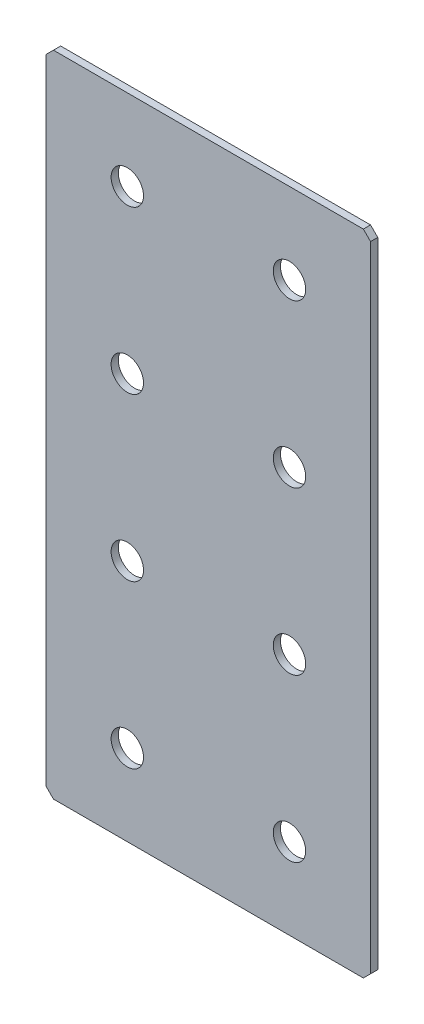
ISO-10303-21;
HEADER;
FILE_DESCRIPTION(('STEP AP214'),'2;1');
FILE_NAME('part.step','',(''),(''),'','','');
FILE_SCHEMA(('AUTOMOTIVE_DESIGN { 1 0 10303 214 1 1 1 1 }'));
ENDSEC;
DATA;
#1=APPLICATION_CONTEXT('core data for automotive mechanical design processes');
#2=APPLICATION_PROTOCOL_DEFINITION('international standard','automotive_design',2000,#1);
#3=PRODUCT_CONTEXT('',#1,'mechanical');
#4=PRODUCT('Part','Part','',(#3));
#5=PRODUCT_RELATED_PRODUCT_CATEGORY('part','',(#4));
#6=PRODUCT_DEFINITION_FORMATION('','',#4);
#7=PRODUCT_DEFINITION_CONTEXT('part definition',#1,'design');
#8=PRODUCT_DEFINITION('design','',#6,#7);
#9=PRODUCT_DEFINITION_SHAPE('','',#8);
#10=(LENGTH_UNIT() NAMED_UNIT(*) SI_UNIT(.MILLI.,.METRE.));
#11=(NAMED_UNIT(*) PLANE_ANGLE_UNIT() SI_UNIT($,.RADIAN.));
#12=(NAMED_UNIT(*) SI_UNIT($,.STERADIAN.) SOLID_ANGLE_UNIT());
#13=UNCERTAINTY_MEASURE_WITH_UNIT(LENGTH_MEASURE(1.E-05),#10,'distance_accuracy_value','');
#14=(GEOMETRIC_REPRESENTATION_CONTEXT(3) GLOBAL_UNCERTAINTY_ASSIGNED_CONTEXT((#13)) GLOBAL_UNIT_ASSIGNED_CONTEXT((#10,
#11,#12)) REPRESENTATION_CONTEXT('',''));
#15=CARTESIAN_POINT('',(0.,0.,0.));
#16=DIRECTION('',(0.,0.,1.));
#17=DIRECTION('',(1.,0.,0.));
#18=AXIS2_PLACEMENT_3D('',#15,#16,#17);
#19=CARTESIAN_POINT('',(45.,-90.,2.));
#20=DIRECTION('',(-1.,0.,0.));
#21=DIRECTION('',(0.,0.,1.));
#22=AXIS2_PLACEMENT_3D('',#19,#20,#21);
#23=PLANE('',#22);
#24=DIRECTION('',(0.,1.,0.));
#25=VECTOR('',#24,1.);
#26=CARTESIAN_POINT('',(45.,-90.,2.));
#27=LINE('',#26,#25);
#28=CARTESIAN_POINT('',(45.,-88.,2.));
#29=VERTEX_POINT('',#28);
#30=CARTESIAN_POINT('',(45.,87.9999999999999,2.));
#31=VERTEX_POINT('',#30);
#32=EDGE_CURVE('E128',#29,#31,#27,.T.);
#33=ORIENTED_EDGE('',*,*,#32,.F.);
#34=DIRECTION('',(0.,0.,-1.));
#35=VECTOR('',#34,1.);
#36=CARTESIAN_POINT('',(45.,-88.,2.));
#37=LINE('',#36,#35);
#38=CARTESIAN_POINT('',(45.,-88.,0.));
#39=VERTEX_POINT('',#38);
#40=EDGE_CURVE('E154',#29,#39,#37,.T.);
#41=ORIENTED_EDGE('',*,*,#40,.T.);
#42=DIRECTION('',(0.,1.,0.));
#43=VECTOR('',#42,1.);
#44=CARTESIAN_POINT('',(45.,-90.,0.));
#45=LINE('',#44,#43);
#46=CARTESIAN_POINT('',(45.,87.9999999999999,0.));
#47=VERTEX_POINT('',#46);
#48=EDGE_CURVE('E162',#39,#47,#45,.T.);
#49=ORIENTED_EDGE('',*,*,#48,.T.);
#50=DIRECTION('',(0.,0.,1.));
#51=VECTOR('',#50,1.);
#52=CARTESIAN_POINT('',(45.,88.,2.));
#53=LINE('',#52,#51);
#54=EDGE_CURVE('E152',#47,#31,#53,.T.);
#55=ORIENTED_EDGE('',*,*,#54,.T.);
#56=EDGE_LOOP('',(#33,#41,#49,#55));
#57=FACE_BOUND('',#56,.T.);
#58=ADVANCED_FACE('F37',(#57),#23,.F.);
#59=CARTESIAN_POINT('',(-45.,90.,2.));
#60=DIRECTION('',(0.,-1.,0.));
#61=DIRECTION('',(0.,0.,-1.));
#62=AXIS2_PLACEMENT_3D('',#59,#60,#61);
#63=PLANE('',#62);
#64=DIRECTION('',(-1.,0.,0.));
#65=VECTOR('',#64,1.);
#66=CARTESIAN_POINT('',(-45.,90.,0.));
#67=LINE('',#66,#65);
#68=CARTESIAN_POINT('',(43.,90.,0.));
#69=VERTEX_POINT('',#68);
#70=CARTESIAN_POINT('',(-43.,90.,0.));
#71=VERTEX_POINT('',#70);
#72=EDGE_CURVE('E133',#69,#71,#67,.T.);
#73=ORIENTED_EDGE('',*,*,#72,.T.);
#74=DIRECTION('',(0.,0.,1.));
#75=VECTOR('',#74,1.);
#76=CARTESIAN_POINT('',(-43.,90.,2.));
#77=LINE('',#76,#75);
#78=CARTESIAN_POINT('',(-43.,90.,2.));
#79=VERTEX_POINT('',#78);
#80=EDGE_CURVE('E11',#71,#79,#77,.T.);
#81=ORIENTED_EDGE('',*,*,#80,.T.);
#82=DIRECTION('',(-1.,0.,0.));
#83=VECTOR('',#82,1.);
#84=CARTESIAN_POINT('',(-45.,90.,2.));
#85=LINE('',#84,#83);
#86=CARTESIAN_POINT('',(43.,90.,2.));
#87=VERTEX_POINT('',#86);
#88=EDGE_CURVE('E131',#87,#79,#85,.T.);
#89=ORIENTED_EDGE('',*,*,#88,.F.);
#90=DIRECTION('',(0.,0.,-1.));
#91=VECTOR('',#90,1.);
#92=CARTESIAN_POINT('',(43.,90.,2.));
#93=LINE('',#92,#91);
#94=EDGE_CURVE('E45',#87,#69,#93,.T.);
#95=ORIENTED_EDGE('',*,*,#94,.T.);
#96=EDGE_LOOP('',(#73,#81,#89,#95));
#97=FACE_BOUND('',#96,.T.);
#98=ADVANCED_FACE('F159',(#97),#63,.F.);
#99=CARTESIAN_POINT('',(-45.,-90.,2.));
#100=DIRECTION('',(1.,0.,0.));
#101=DIRECTION('',(0.,0.,-1.));
#102=AXIS2_PLACEMENT_3D('',#99,#100,#101);
#103=PLANE('',#102);
#104=DIRECTION('',(0.,-1.,0.));
#105=VECTOR('',#104,1.);
#106=CARTESIAN_POINT('',(-45.,-90.,0.));
#107=LINE('',#106,#105);
#108=CARTESIAN_POINT('',(-45.,88.,0.));
#109=VERTEX_POINT('',#108);
#110=CARTESIAN_POINT('',(-45.,-88.,0.));
#111=VERTEX_POINT('',#110);
#112=EDGE_CURVE('E129',#109,#111,#107,.T.);
#113=ORIENTED_EDGE('',*,*,#112,.T.);
#114=DIRECTION('',(0.,0.,1.));
#115=VECTOR('',#114,1.);
#116=CARTESIAN_POINT('',(-45.,-88.,2.));
#117=LINE('',#116,#115);
#118=CARTESIAN_POINT('',(-45.,-88.,2.));
#119=VERTEX_POINT('',#118);
#120=EDGE_CURVE('E107',#111,#119,#117,.T.);
#121=ORIENTED_EDGE('',*,*,#120,.T.);
#122=DIRECTION('',(0.,-1.,0.));
#123=VECTOR('',#122,1.);
#124=CARTESIAN_POINT('',(-45.,-90.,2.));
#125=LINE('',#124,#123);
#126=CARTESIAN_POINT('',(-45.,88.,2.));
#127=VERTEX_POINT('',#126);
#128=EDGE_CURVE('E167',#127,#119,#125,.T.);
#129=ORIENTED_EDGE('',*,*,#128,.F.);
#130=DIRECTION('',(0.,0.,-1.));
#131=VECTOR('',#130,1.);
#132=CARTESIAN_POINT('',(-45.,88.,2.));
#133=LINE('',#132,#131);
#134=EDGE_CURVE('E112',#127,#109,#133,.T.);
#135=ORIENTED_EDGE('',*,*,#134,.T.);
#136=EDGE_LOOP('',(#113,#121,#129,#135));
#137=FACE_BOUND('',#136,.T.);
#138=ADVANCED_FACE('F242',(#137),#103,.F.);
#139=CARTESIAN_POINT('',(-45.,-90.,2.));
#140=DIRECTION('',(0.,1.,0.));
#141=DIRECTION('',(0.,0.,1.));
#142=AXIS2_PLACEMENT_3D('',#139,#140,#141);
#143=PLANE('',#142);
#144=DIRECTION('',(1.,0.,0.));
#145=VECTOR('',#144,1.);
#146=CARTESIAN_POINT('',(-45.,-90.,2.));
#147=LINE('',#146,#145);
#148=CARTESIAN_POINT('',(-43.,-90.,2.));
#149=VERTEX_POINT('',#148);
#150=CARTESIAN_POINT('',(43.,-90.,2.));
#151=VERTEX_POINT('',#150);
#152=EDGE_CURVE('E122',#149,#151,#147,.T.);
#153=ORIENTED_EDGE('',*,*,#152,.F.);
#154=DIRECTION('',(0.,0.,-1.));
#155=VECTOR('',#154,1.);
#156=CARTESIAN_POINT('',(-43.,-90.,2.));
#157=LINE('',#156,#155);
#158=CARTESIAN_POINT('',(-43.,-90.,0.));
#159=VERTEX_POINT('',#158);
#160=EDGE_CURVE('E106',#149,#159,#157,.T.);
#161=ORIENTED_EDGE('',*,*,#160,.T.);
#162=DIRECTION('',(1.,0.,0.));
#163=VECTOR('',#162,1.);
#164=CARTESIAN_POINT('',(-45.,-90.,0.));
#165=LINE('',#164,#163);
#166=CARTESIAN_POINT('',(43.,-90.,0.));
#167=VERTEX_POINT('',#166);
#168=EDGE_CURVE('E119',#159,#167,#165,.T.);
#169=ORIENTED_EDGE('',*,*,#168,.T.);
#170=DIRECTION('',(0.,0.,1.));
#171=VECTOR('',#170,1.);
#172=CARTESIAN_POINT('',(43.,-90.,2.));
#173=LINE('',#172,#171);
#174=EDGE_CURVE('E124',#167,#151,#173,.T.);
#175=ORIENTED_EDGE('',*,*,#174,.T.);
#176=EDGE_LOOP('',(#153,#161,#169,#175));
#177=FACE_BOUND('',#176,.T.);
#178=ADVANCED_FACE('F118',(#177),#143,.F.);
#179=CARTESIAN_POINT('',(0.,0.,2.));
#180=DIRECTION('',(0.,0.,-1.));
#181=DIRECTION('',(-1.,0.,0.));
#182=AXIS2_PLACEMENT_3D('',#179,#180,#181);
#183=PLANE('',#182);
#184=CARTESIAN_POINT('',(-22.5,22.5,2.));
#185=DIRECTION('',(0.,0.,1.));
#186=DIRECTION('',(1.,0.,0.));
#187=AXIS2_PLACEMENT_3D('',#184,#185,#186);
#188=CIRCLE('',#187,4.5);
#189=CARTESIAN_POINT('',(-18.,22.5,2.));
#190=VERTEX_POINT('',#189);
#191=EDGE_CURVE('E215',#190,#190,#188,.T.);
#192=ORIENTED_EDGE('',*,*,#191,.F.);
#193=EDGE_LOOP('',(#192));
#194=FACE_BOUND('',#193,.T.);
#195=CARTESIAN_POINT('',(22.5,22.5,2.));
#196=DIRECTION('',(0.,0.,1.));
#197=DIRECTION('',(1.,0.,0.));
#198=AXIS2_PLACEMENT_3D('',#195,#196,#197);
#199=CIRCLE('',#198,4.5);
#200=CARTESIAN_POINT('',(27.,22.5,2.));
#201=VERTEX_POINT('',#200);
#202=EDGE_CURVE('E209',#201,#201,#199,.T.);
#203=ORIENTED_EDGE('',*,*,#202,.F.);
#204=EDGE_LOOP('',(#203));
#205=FACE_BOUND('',#204,.T.);
#206=CARTESIAN_POINT('',(-22.5,-22.5,2.));
#207=DIRECTION('',(0.,0.,1.));
#208=DIRECTION('',(1.,0.,0.));
#209=AXIS2_PLACEMENT_3D('',#206,#207,#208);
#210=CIRCLE('',#209,4.5);
#211=CARTESIAN_POINT('',(-18.,-22.5,2.));
#212=VERTEX_POINT('',#211);
#213=EDGE_CURVE('E203',#212,#212,#210,.T.);
#214=ORIENTED_EDGE('',*,*,#213,.F.);
#215=EDGE_LOOP('',(#214));
#216=FACE_BOUND('',#215,.T.);
#217=CARTESIAN_POINT('',(22.5,-22.5,2.));
#218=DIRECTION('',(0.,0.,1.));
#219=DIRECTION('',(1.,0.,0.));
#220=AXIS2_PLACEMENT_3D('',#217,#218,#219);
#221=CIRCLE('',#220,4.5);
#222=CARTESIAN_POINT('',(27.,-22.5,2.));
#223=VERTEX_POINT('',#222);
#224=EDGE_CURVE('E197',#223,#223,#221,.T.);
#225=ORIENTED_EDGE('',*,*,#224,.F.);
#226=EDGE_LOOP('',(#225));
#227=FACE_BOUND('',#226,.T.);
#228=CARTESIAN_POINT('',(-22.5,67.5,2.));
#229=DIRECTION('',(0.,0.,1.));
#230=DIRECTION('',(1.,0.,0.));
#231=AXIS2_PLACEMENT_3D('',#228,#229,#230);
#232=CIRCLE('',#231,4.5);
#233=CARTESIAN_POINT('',(-18.,67.5,2.));
#234=VERTEX_POINT('',#233);
#235=EDGE_CURVE('E191',#234,#234,#232,.T.);
#236=ORIENTED_EDGE('',*,*,#235,.F.);
#237=EDGE_LOOP('',(#236));
#238=FACE_BOUND('',#237,.T.);
#239=CARTESIAN_POINT('',(22.5,67.5,2.));
#240=DIRECTION('',(0.,0.,1.));
#241=DIRECTION('',(1.,0.,0.));
#242=AXIS2_PLACEMENT_3D('',#239,#240,#241);
#243=CIRCLE('',#242,4.5);
#244=CARTESIAN_POINT('',(27.,67.5,2.));
#245=VERTEX_POINT('',#244);
#246=EDGE_CURVE('E185',#245,#245,#243,.T.);
#247=ORIENTED_EDGE('',*,*,#246,.F.);
#248=EDGE_LOOP('',(#247));
#249=FACE_BOUND('',#248,.T.);
#250=CARTESIAN_POINT('',(22.5,-67.5,2.));
#251=DIRECTION('',(0.,0.,1.));
#252=DIRECTION('',(1.,0.,0.));
#253=AXIS2_PLACEMENT_3D('',#250,#251,#252);
#254=CIRCLE('',#253,4.5);
#255=CARTESIAN_POINT('',(27.,-67.5,2.));
#256=VERTEX_POINT('',#255);
#257=EDGE_CURVE('E179',#256,#256,#254,.T.);
#258=ORIENTED_EDGE('',*,*,#257,.F.);
#259=EDGE_LOOP('',(#258));
#260=FACE_BOUND('',#259,.T.);
#261=CARTESIAN_POINT('',(-22.5,-67.5,2.));
#262=DIRECTION('',(0.,0.,1.));
#263=DIRECTION('',(1.,0.,0.));
#264=AXIS2_PLACEMENT_3D('',#261,#262,#263);
#265=CIRCLE('',#264,4.5);
#266=CARTESIAN_POINT('',(-18.,-67.5,2.));
#267=VERTEX_POINT('',#266);
#268=EDGE_CURVE('E173',#267,#267,#265,.T.);
#269=ORIENTED_EDGE('',*,*,#268,.F.);
#270=EDGE_LOOP('',(#269));
#271=FACE_BOUND('',#270,.T.);
#272=ORIENTED_EDGE('',*,*,#128,.T.);
#273=DIRECTION('',(-0.707106781186548,0.707106781186548,0.));
#274=VECTOR('',#273,1.);
#275=CARTESIAN_POINT('',(-43.,-90.,2.));
#276=LINE('',#275,#274);
#277=EDGE_CURVE('E150',#119,#149,#276,.F.);
#278=ORIENTED_EDGE('',*,*,#277,.T.);
#279=ORIENTED_EDGE('',*,*,#152,.T.);
#280=DIRECTION('',(-0.707106781186552,-0.707106781186543,0.));
#281=VECTOR('',#280,1.);
#282=CARTESIAN_POINT('',(45.,-88.,2.));
#283=LINE('',#282,#281);
#284=EDGE_CURVE('E148',#151,#29,#283,.F.);
#285=ORIENTED_EDGE('',*,*,#284,.T.);
#286=ORIENTED_EDGE('',*,*,#32,.T.);
#287=DIRECTION('',(0.707106781186548,-0.707106781186548,0.));
#288=VECTOR('',#287,1.);
#289=CARTESIAN_POINT('',(43.,90.,2.));
#290=LINE('',#289,#288);
#291=EDGE_CURVE('E57',#31,#87,#290,.F.);
#292=ORIENTED_EDGE('',*,*,#291,.T.);
#293=ORIENTED_EDGE('',*,*,#88,.T.);
#294=DIRECTION('',(0.707106781186552,0.707106781186543,0.));
#295=VECTOR('',#294,1.);
#296=CARTESIAN_POINT('',(-45.,88.,2.));
#297=LINE('',#296,#295);
#298=EDGE_CURVE('E146',#79,#127,#297,.F.);
#299=ORIENTED_EDGE('',*,*,#298,.T.);
#300=EDGE_LOOP('',(#272,#278,#279,#285,#286,#292,#293,#299));
#301=FACE_BOUND('',#300,.T.);
#302=ADVANCED_FACE('F221',(#194,#205,#216,#227,#238,#249,#260,#271,#301),#183,.F.);
#303=CARTESIAN_POINT('',(0.,0.,0.));
#304=DIRECTION('',(0.,0.,-1.));
#305=DIRECTION('',(-1.,0.,0.));
#306=AXIS2_PLACEMENT_3D('',#303,#304,#305);
#307=PLANE('',#306);
#308=CARTESIAN_POINT('',(-22.5,22.5,0.));
#309=DIRECTION('',(0.,0.,1.));
#310=DIRECTION('',(1.,0.,0.));
#311=AXIS2_PLACEMENT_3D('',#308,#309,#310);
#312=CIRCLE('',#311,4.5);
#313=CARTESIAN_POINT('',(-18.,22.5,0.));
#314=VERTEX_POINT('',#313);
#315=EDGE_CURVE('E212',#314,#314,#312,.T.);
#316=ORIENTED_EDGE('',*,*,#315,.T.);
#317=EDGE_LOOP('',(#316));
#318=FACE_BOUND('',#317,.T.);
#319=CARTESIAN_POINT('',(22.5,22.5,0.));
#320=DIRECTION('',(0.,0.,1.));
#321=DIRECTION('',(1.,0.,0.));
#322=AXIS2_PLACEMENT_3D('',#319,#320,#321);
#323=CIRCLE('',#322,4.5);
#324=CARTESIAN_POINT('',(27.,22.5,0.));
#325=VERTEX_POINT('',#324);
#326=EDGE_CURVE('E206',#325,#325,#323,.T.);
#327=ORIENTED_EDGE('',*,*,#326,.T.);
#328=EDGE_LOOP('',(#327));
#329=FACE_BOUND('',#328,.T.);
#330=CARTESIAN_POINT('',(-22.5,-22.5,0.));
#331=DIRECTION('',(0.,0.,1.));
#332=DIRECTION('',(1.,0.,0.));
#333=AXIS2_PLACEMENT_3D('',#330,#331,#332);
#334=CIRCLE('',#333,4.5);
#335=CARTESIAN_POINT('',(-18.,-22.5,0.));
#336=VERTEX_POINT('',#335);
#337=EDGE_CURVE('E200',#336,#336,#334,.T.);
#338=ORIENTED_EDGE('',*,*,#337,.T.);
#339=EDGE_LOOP('',(#338));
#340=FACE_BOUND('',#339,.T.);
#341=CARTESIAN_POINT('',(22.5,-22.5,0.));
#342=DIRECTION('',(0.,0.,1.));
#343=DIRECTION('',(1.,0.,0.));
#344=AXIS2_PLACEMENT_3D('',#341,#342,#343);
#345=CIRCLE('',#344,4.5);
#346=CARTESIAN_POINT('',(27.,-22.5,0.));
#347=VERTEX_POINT('',#346);
#348=EDGE_CURVE('E194',#347,#347,#345,.T.);
#349=ORIENTED_EDGE('',*,*,#348,.T.);
#350=EDGE_LOOP('',(#349));
#351=FACE_BOUND('',#350,.T.);
#352=CARTESIAN_POINT('',(-22.5,67.5,0.));
#353=DIRECTION('',(0.,0.,1.));
#354=DIRECTION('',(1.,0.,0.));
#355=AXIS2_PLACEMENT_3D('',#352,#353,#354);
#356=CIRCLE('',#355,4.5);
#357=CARTESIAN_POINT('',(-18.,67.5,0.));
#358=VERTEX_POINT('',#357);
#359=EDGE_CURVE('E188',#358,#358,#356,.T.);
#360=ORIENTED_EDGE('',*,*,#359,.T.);
#361=EDGE_LOOP('',(#360));
#362=FACE_BOUND('',#361,.T.);
#363=CARTESIAN_POINT('',(22.5,67.5,0.));
#364=DIRECTION('',(0.,0.,1.));
#365=DIRECTION('',(1.,0.,0.));
#366=AXIS2_PLACEMENT_3D('',#363,#364,#365);
#367=CIRCLE('',#366,4.5);
#368=CARTESIAN_POINT('',(27.,67.5,0.));
#369=VERTEX_POINT('',#368);
#370=EDGE_CURVE('E182',#369,#369,#367,.T.);
#371=ORIENTED_EDGE('',*,*,#370,.T.);
#372=EDGE_LOOP('',(#371));
#373=FACE_BOUND('',#372,.T.);
#374=CARTESIAN_POINT('',(22.5,-67.5,0.));
#375=DIRECTION('',(0.,0.,1.));
#376=DIRECTION('',(1.,0.,0.));
#377=AXIS2_PLACEMENT_3D('',#374,#375,#376);
#378=CIRCLE('',#377,4.5);
#379=CARTESIAN_POINT('',(27.,-67.5,0.));
#380=VERTEX_POINT('',#379);
#381=EDGE_CURVE('E176',#380,#380,#378,.T.);
#382=ORIENTED_EDGE('',*,*,#381,.T.);
#383=EDGE_LOOP('',(#382));
#384=FACE_BOUND('',#383,.T.);
#385=CARTESIAN_POINT('',(-22.5,-67.5,0.));
#386=DIRECTION('',(0.,0.,1.));
#387=DIRECTION('',(1.,0.,0.));
#388=AXIS2_PLACEMENT_3D('',#385,#386,#387);
#389=CIRCLE('',#388,4.5);
#390=CARTESIAN_POINT('',(-18.,-67.5,0.));
#391=VERTEX_POINT('',#390);
#392=EDGE_CURVE('E163',#391,#391,#389,.T.);
#393=ORIENTED_EDGE('',*,*,#392,.T.);
#394=EDGE_LOOP('',(#393));
#395=FACE_BOUND('',#394,.T.);
#396=ORIENTED_EDGE('',*,*,#168,.F.);
#397=DIRECTION('',(0.707106781186548,-0.707106781186548,0.));
#398=VECTOR('',#397,1.);
#399=CARTESIAN_POINT('',(-66.5,-66.5,0.));
#400=LINE('',#399,#398);
#401=EDGE_CURVE('E102',#159,#111,#400,.F.);
#402=ORIENTED_EDGE('',*,*,#401,.T.);
#403=ORIENTED_EDGE('',*,*,#112,.F.);
#404=DIRECTION('',(-0.707106781186552,-0.707106781186543,0.));
#405=VECTOR('',#404,1.);
#406=CARTESIAN_POINT('',(-66.4999999999997,66.5000000000006,0.));
#407=LINE('',#406,#405);
#408=EDGE_CURVE('E139',#109,#71,#407,.F.);
#409=ORIENTED_EDGE('',*,*,#408,.T.);
#410=ORIENTED_EDGE('',*,*,#72,.F.);
#411=DIRECTION('',(-0.707106781186548,0.707106781186548,0.));
#412=VECTOR('',#411,1.);
#413=CARTESIAN_POINT('',(66.5,66.5,0.));
#414=LINE('',#413,#412);
#415=EDGE_CURVE('E123',#69,#47,#414,.F.);
#416=ORIENTED_EDGE('',*,*,#415,.T.);
#417=ORIENTED_EDGE('',*,*,#48,.F.);
#418=DIRECTION('',(0.707106781186552,0.707106781186543,0.));
#419=VECTOR('',#418,1.);
#420=CARTESIAN_POINT('',(66.4999999999997,-66.5000000000006,0.));
#421=LINE('',#420,#419);
#422=EDGE_CURVE('E113',#39,#167,#421,.F.);
#423=ORIENTED_EDGE('',*,*,#422,.T.);
#424=EDGE_LOOP('',(#396,#402,#403,#409,#410,#416,#417,#423));
#425=FACE_BOUND('',#424,.T.);
#426=ADVANCED_FACE('F126',(#318,#329,#340,#351,#362,#373,#384,#395,#425),#307,.T.);
#427=CARTESIAN_POINT('',(-43.,-90.,2.));
#428=DIRECTION('',(0.707106781186547,0.707106781186547,0.));
#429=DIRECTION('',(0.,0.,-1.));
#430=AXIS2_PLACEMENT_3D('',#427,#428,#429);
#431=PLANE('',#430);
#432=ORIENTED_EDGE('',*,*,#277,.F.);
#433=ORIENTED_EDGE('',*,*,#120,.F.);
#434=ORIENTED_EDGE('',*,*,#401,.F.);
#435=ORIENTED_EDGE('',*,*,#160,.F.);
#436=EDGE_LOOP('',(#432,#433,#434,#435));
#437=FACE_BOUND('',#436,.T.);
#438=ADVANCED_FACE('F105',(#437),#431,.F.);
#439=CARTESIAN_POINT('',(45.,-88.,2.));
#440=DIRECTION('',(-0.707106781186543,0.707106781186552,0.));
#441=DIRECTION('',(0.,0.,-1.));
#442=AXIS2_PLACEMENT_3D('',#439,#440,#441);
#443=PLANE('',#442);
#444=ORIENTED_EDGE('',*,*,#284,.F.);
#445=ORIENTED_EDGE('',*,*,#174,.F.);
#446=ORIENTED_EDGE('',*,*,#422,.F.);
#447=ORIENTED_EDGE('',*,*,#40,.F.);
#448=EDGE_LOOP('',(#444,#445,#446,#447));
#449=FACE_BOUND('',#448,.T.);
#450=ADVANCED_FACE('F246',(#449),#443,.F.);
#451=CARTESIAN_POINT('',(-45.,88.,2.));
#452=DIRECTION('',(0.707106781186543,-0.707106781186552,0.));
#453=DIRECTION('',(0.,0.,-1.));
#454=AXIS2_PLACEMENT_3D('',#451,#452,#453);
#455=PLANE('',#454);
#456=ORIENTED_EDGE('',*,*,#298,.F.);
#457=ORIENTED_EDGE('',*,*,#80,.F.);
#458=ORIENTED_EDGE('',*,*,#408,.F.);
#459=ORIENTED_EDGE('',*,*,#134,.F.);
#460=EDGE_LOOP('',(#456,#457,#458,#459));
#461=FACE_BOUND('',#460,.T.);
#462=ADVANCED_FACE('F244',(#461),#455,.F.);
#463=CARTESIAN_POINT('',(43.,90.,2.));
#464=DIRECTION('',(-0.707106781186547,-0.707106781186547,0.));
#465=DIRECTION('',(0.,0.,-1.));
#466=AXIS2_PLACEMENT_3D('',#463,#464,#465);
#467=PLANE('',#466);
#468=ORIENTED_EDGE('',*,*,#291,.F.);
#469=ORIENTED_EDGE('',*,*,#54,.F.);
#470=ORIENTED_EDGE('',*,*,#415,.F.);
#471=ORIENTED_EDGE('',*,*,#94,.F.);
#472=EDGE_LOOP('',(#468,#469,#470,#471));
#473=FACE_BOUND('',#472,.T.);
#474=ADVANCED_FACE('F39',(#473),#467,.F.);
#475=CARTESIAN_POINT('',(-22.5,-67.5,2.));
#476=DIRECTION('',(0.,0.,1.));
#477=DIRECTION('',(1.,0.,0.));
#478=AXIS2_PLACEMENT_3D('',#475,#476,#477);
#479=CYLINDRICAL_SURFACE('',#478,4.5);
#480=ORIENTED_EDGE('',*,*,#392,.F.);
#481=EDGE_LOOP('',(#480));
#482=FACE_BOUND('',#481,.T.);
#483=ORIENTED_EDGE('',*,*,#268,.T.);
#484=EDGE_LOOP('',(#483));
#485=FACE_BOUND('',#484,.T.);
#486=ADVANCED_FACE('F251',(#482,#485),#479,.F.);
#487=CARTESIAN_POINT('',(22.5,-67.5,2.));
#488=DIRECTION('',(0.,0.,1.));
#489=DIRECTION('',(1.,0.,0.));
#490=AXIS2_PLACEMENT_3D('',#487,#488,#489);
#491=CYLINDRICAL_SURFACE('',#490,4.5);
#492=ORIENTED_EDGE('',*,*,#381,.F.);
#493=EDGE_LOOP('',(#492));
#494=FACE_BOUND('',#493,.T.);
#495=ORIENTED_EDGE('',*,*,#257,.T.);
#496=EDGE_LOOP('',(#495));
#497=FACE_BOUND('',#496,.T.);
#498=ADVANCED_FACE('F306',(#494,#497),#491,.F.);
#499=CARTESIAN_POINT('',(22.5,67.5,2.));
#500=DIRECTION('',(0.,0.,1.));
#501=DIRECTION('',(1.,0.,0.));
#502=AXIS2_PLACEMENT_3D('',#499,#500,#501);
#503=CYLINDRICAL_SURFACE('',#502,4.5);
#504=ORIENTED_EDGE('',*,*,#370,.F.);
#505=EDGE_LOOP('',(#504));
#506=FACE_BOUND('',#505,.T.);
#507=ORIENTED_EDGE('',*,*,#246,.T.);
#508=EDGE_LOOP('',(#507));
#509=FACE_BOUND('',#508,.T.);
#510=ADVANCED_FACE('F315',(#506,#509),#503,.F.);
#511=CARTESIAN_POINT('',(-22.5,67.5,2.));
#512=DIRECTION('',(0.,0.,1.));
#513=DIRECTION('',(1.,0.,0.));
#514=AXIS2_PLACEMENT_3D('',#511,#512,#513);
#515=CYLINDRICAL_SURFACE('',#514,4.5);
#516=ORIENTED_EDGE('',*,*,#359,.F.);
#517=EDGE_LOOP('',(#516));
#518=FACE_BOUND('',#517,.T.);
#519=ORIENTED_EDGE('',*,*,#235,.T.);
#520=EDGE_LOOP('',(#519));
#521=FACE_BOUND('',#520,.T.);
#522=ADVANCED_FACE('F325',(#518,#521),#515,.F.);
#523=CARTESIAN_POINT('',(22.5,-22.5,2.));
#524=DIRECTION('',(0.,0.,1.));
#525=DIRECTION('',(1.,0.,0.));
#526=AXIS2_PLACEMENT_3D('',#523,#524,#525);
#527=CYLINDRICAL_SURFACE('',#526,4.5);
#528=ORIENTED_EDGE('',*,*,#348,.F.);
#529=EDGE_LOOP('',(#528));
#530=FACE_BOUND('',#529,.T.);
#531=ORIENTED_EDGE('',*,*,#224,.T.);
#532=EDGE_LOOP('',(#531));
#533=FACE_BOUND('',#532,.T.);
#534=ADVANCED_FACE('F335',(#530,#533),#527,.F.);
#535=CARTESIAN_POINT('',(-22.5,-22.5,2.));
#536=DIRECTION('',(0.,0.,1.));
#537=DIRECTION('',(1.,0.,0.));
#538=AXIS2_PLACEMENT_3D('',#535,#536,#537);
#539=CYLINDRICAL_SURFACE('',#538,4.5);
#540=ORIENTED_EDGE('',*,*,#337,.F.);
#541=EDGE_LOOP('',(#540));
#542=FACE_BOUND('',#541,.T.);
#543=ORIENTED_EDGE('',*,*,#213,.T.);
#544=EDGE_LOOP('',(#543));
#545=FACE_BOUND('',#544,.T.);
#546=ADVANCED_FACE('F345',(#542,#545),#539,.F.);
#547=CARTESIAN_POINT('',(22.5,22.5,2.));
#548=DIRECTION('',(0.,0.,1.));
#549=DIRECTION('',(1.,0.,0.));
#550=AXIS2_PLACEMENT_3D('',#547,#548,#549);
#551=CYLINDRICAL_SURFACE('',#550,4.5);
#552=ORIENTED_EDGE('',*,*,#326,.F.);
#553=EDGE_LOOP('',(#552));
#554=FACE_BOUND('',#553,.T.);
#555=ORIENTED_EDGE('',*,*,#202,.T.);
#556=EDGE_LOOP('',(#555));
#557=FACE_BOUND('',#556,.T.);
#558=ADVANCED_FACE('F355',(#554,#557),#551,.F.);
#559=CARTESIAN_POINT('',(-22.5,22.5,2.));
#560=DIRECTION('',(0.,0.,1.));
#561=DIRECTION('',(1.,0.,0.));
#562=AXIS2_PLACEMENT_3D('',#559,#560,#561);
#563=CYLINDRICAL_SURFACE('',#562,4.5);
#564=ORIENTED_EDGE('',*,*,#315,.F.);
#565=EDGE_LOOP('',(#564));
#566=FACE_BOUND('',#565,.T.);
#567=ORIENTED_EDGE('',*,*,#191,.T.);
#568=EDGE_LOOP('',(#567));
#569=FACE_BOUND('',#568,.T.);
#570=ADVANCED_FACE('F219',(#566,#569),#563,.F.);
#571=CLOSED_SHELL('',(#58,#98,#138,#178,#302,#426,#438,#450,#462,#474,#486,#498,#510,#522,#534,
#546,#558,#570));
#572=MANIFOLD_SOLID_BREP('B2',#571);
#573=ADVANCED_BREP_SHAPE_REPRESENTATION('',(#18,#572),#14);
#574=SHAPE_DEFINITION_REPRESENTATION(#9,#573);
ENDSEC;
END-ISO-10303-21;
